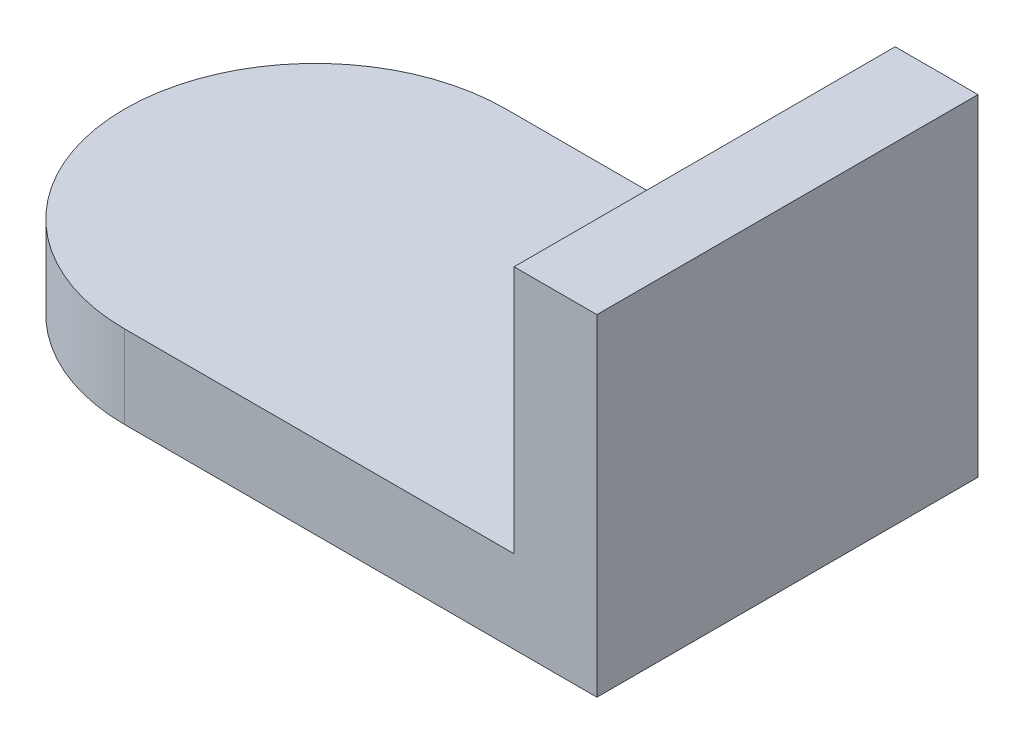
ISO-10303-21;
HEADER;
FILE_DESCRIPTION(('STEP AP214'),'2;1');
FILE_NAME('part.step','',(''),(''),'','','');
FILE_SCHEMA(('AUTOMOTIVE_DESIGN { 1 0 10303 214 1 1 1 1 }'));
ENDSEC;
DATA;
#1=APPLICATION_CONTEXT('core data for automotive mechanical design processes');
#2=APPLICATION_PROTOCOL_DEFINITION('international standard','automotive_design',2000,#1);
#3=PRODUCT_CONTEXT('',#1,'mechanical');
#4=PRODUCT('Part','Part','',(#3));
#5=PRODUCT_RELATED_PRODUCT_CATEGORY('part','',(#4));
#6=PRODUCT_DEFINITION_FORMATION('','',#4);
#7=PRODUCT_DEFINITION_CONTEXT('part definition',#1,'design');
#8=PRODUCT_DEFINITION('design','',#6,#7);
#9=PRODUCT_DEFINITION_SHAPE('','',#8);
#10=(LENGTH_UNIT() NAMED_UNIT(*) SI_UNIT(.MILLI.,.METRE.));
#11=(NAMED_UNIT(*) PLANE_ANGLE_UNIT() SI_UNIT($,.RADIAN.));
#12=(NAMED_UNIT(*) SI_UNIT($,.STERADIAN.) SOLID_ANGLE_UNIT());
#13=UNCERTAINTY_MEASURE_WITH_UNIT(LENGTH_MEASURE(1.E-05),#10,'distance_accuracy_value','');
#14=(GEOMETRIC_REPRESENTATION_CONTEXT(3) GLOBAL_UNCERTAINTY_ASSIGNED_CONTEXT((#13)) GLOBAL_UNIT_ASSIGNED_CONTEXT((#10,
#11,#12)) REPRESENTATION_CONTEXT('',''));
#15=CARTESIAN_POINT('',(0.,0.,0.));
#16=DIRECTION('',(0.,0.,1.));
#17=DIRECTION('',(1.,0.,0.));
#18=AXIS2_PLACEMENT_3D('',#15,#16,#17);
#19=CARTESIAN_POINT('',(1.45,-0.2,-0.365));
#20=DIRECTION('',(0.,0.,-1.));
#21=DIRECTION('',(1.,0.,0.));
#22=AXIS2_PLACEMENT_3D('',#19,#20,#21);
#23=PLANE('',#22);
#24=DIRECTION('',(0.,-1.,0.));
#25=VECTOR('',#24,1.);
#26=CARTESIAN_POINT('',(1.5,-0.2,-0.365));
#27=LINE('',#26,#25);
#28=CARTESIAN_POINT('',(1.5,-0.2,-0.365));
#29=VERTEX_POINT('',#28);
#30=CARTESIAN_POINT('',(1.5,-0.4,-0.365));
#31=VERTEX_POINT('',#30);
#32=EDGE_CURVE('E11',#29,#31,#27,.T.);
#33=ORIENTED_EDGE('',*,*,#32,.T.);
#34=DIRECTION('',(1.,0.,0.));
#35=VECTOR('',#34,1.);
#36=CARTESIAN_POINT('',(1.45,-0.4,-0.365));
#37=LINE('',#36,#35);
#38=CARTESIAN_POINT('',(1.215,-0.4,-0.365));
#39=VERTEX_POINT('',#38);
#40=EDGE_CURVE('E24',#39,#31,#37,.T.);
#41=ORIENTED_EDGE('',*,*,#40,.F.);
#42=DIRECTION('',(0.,-1.,0.));
#43=VECTOR('',#42,1.);
#44=CARTESIAN_POINT('',(1.215,-0.35,-0.365));
#45=LINE('',#44,#43);
#46=CARTESIAN_POINT('',(1.215,-0.35,-0.365));
#47=VERTEX_POINT('',#46);
#48=EDGE_CURVE('E86',#47,#39,#45,.T.);
#49=ORIENTED_EDGE('',*,*,#48,.F.);
#50=DIRECTION('',(-1.,0.,0.));
#51=VECTOR('',#50,1.);
#52=CARTESIAN_POINT('',(1.45,-0.35,-0.365));
#53=LINE('',#52,#51);
#54=CARTESIAN_POINT('',(1.45,-0.35,-0.365));
#55=VERTEX_POINT('',#54);
#56=EDGE_CURVE('E115',#55,#47,#53,.T.);
#57=ORIENTED_EDGE('',*,*,#56,.F.);
#58=DIRECTION('',(0.,-1.,0.));
#59=VECTOR('',#58,1.);
#60=CARTESIAN_POINT('',(1.45,-0.2,-0.365));
#61=LINE('',#60,#59);
#62=CARTESIAN_POINT('',(1.45,-0.2,-0.365));
#63=VERTEX_POINT('',#62);
#64=EDGE_CURVE('E112',#63,#55,#61,.T.);
#65=ORIENTED_EDGE('',*,*,#64,.F.);
#66=DIRECTION('',(1.,0.,0.));
#67=VECTOR('',#66,1.);
#68=CARTESIAN_POINT('',(1.45,-0.2,-0.365));
#69=LINE('',#68,#67);
#70=EDGE_CURVE('E110',#63,#29,#69,.T.);
#71=ORIENTED_EDGE('',*,*,#70,.T.);
#72=EDGE_LOOP('',(#33,#41,#49,#57,#65,#71));
#73=FACE_BOUND('',#72,.T.);
#74=ADVANCED_FACE('F17',(#73),#23,.T.);
#75=CARTESIAN_POINT('',(1.45,-0.2,-0.365));
#76=DIRECTION('',(0.,1.,0.));
#77=DIRECTION('',(0.,0.,1.));
#78=AXIS2_PLACEMENT_3D('',#75,#76,#77);
#79=PLANE('',#78);
#80=DIRECTION('',(0.,0.,-1.));
#81=VECTOR('',#80,1.);
#82=CARTESIAN_POINT('',(1.5,-0.2,-0.365));
#83=LINE('',#82,#81);
#84=CARTESIAN_POINT('',(1.5,-0.2,-0.135));
#85=VERTEX_POINT('',#84);
#86=EDGE_CURVE('E107',#85,#29,#83,.T.);
#87=ORIENTED_EDGE('',*,*,#86,.T.);
#88=ORIENTED_EDGE('',*,*,#70,.F.);
#89=DIRECTION('',(0.,0.,-1.));
#90=VECTOR('',#89,1.);
#91=CARTESIAN_POINT('',(1.45,-0.2,-0.365));
#92=LINE('',#91,#90);
#93=CARTESIAN_POINT('',(1.45,-0.2,-0.135));
#94=VERTEX_POINT('',#93);
#95=EDGE_CURVE('E104',#94,#63,#92,.T.);
#96=ORIENTED_EDGE('',*,*,#95,.F.);
#97=DIRECTION('',(1.,0.,0.));
#98=VECTOR('',#97,1.);
#99=CARTESIAN_POINT('',(1.45,-0.2,-0.135));
#100=LINE('',#99,#98);
#101=EDGE_CURVE('E101',#94,#85,#100,.T.);
#102=ORIENTED_EDGE('',*,*,#101,.T.);
#103=EDGE_LOOP('',(#87,#88,#96,#102));
#104=FACE_BOUND('',#103,.T.);
#105=ADVANCED_FACE('F127',(#104),#79,.T.);
#106=CARTESIAN_POINT('',(1.45,-0.2,-0.135));
#107=DIRECTION('',(0.,0.,1.));
#108=DIRECTION('',(0.,-1.,0.));
#109=AXIS2_PLACEMENT_3D('',#106,#107,#108);
#110=PLANE('',#109);
#111=DIRECTION('',(0.,1.,0.));
#112=VECTOR('',#111,1.);
#113=CARTESIAN_POINT('',(1.5,-0.2,-0.135));
#114=LINE('',#113,#112);
#115=CARTESIAN_POINT('',(1.5,-0.4,-0.134999999999999));
#116=VERTEX_POINT('',#115);
#117=EDGE_CURVE('E99',#116,#85,#114,.T.);
#118=ORIENTED_EDGE('',*,*,#117,.T.);
#119=ORIENTED_EDGE('',*,*,#101,.F.);
#120=DIRECTION('',(0.,1.,0.));
#121=VECTOR('',#120,1.);
#122=CARTESIAN_POINT('',(1.45,-0.2,-0.135));
#123=LINE('',#122,#121);
#124=CARTESIAN_POINT('',(1.45,-0.35,-0.135));
#125=VERTEX_POINT('',#124);
#126=EDGE_CURVE('E96',#125,#94,#123,.T.);
#127=ORIENTED_EDGE('',*,*,#126,.F.);
#128=DIRECTION('',(1.,0.,0.));
#129=VECTOR('',#128,1.);
#130=CARTESIAN_POINT('',(1.45,-0.35,-0.135));
#131=LINE('',#130,#129);
#132=CARTESIAN_POINT('',(1.215,-0.35,-0.134999999999999));
#133=VERTEX_POINT('',#132);
#134=EDGE_CURVE('E72',#133,#125,#131,.T.);
#135=ORIENTED_EDGE('',*,*,#134,.F.);
#136=DIRECTION('',(0.,-1.,0.));
#137=VECTOR('',#136,1.);
#138=CARTESIAN_POINT('',(1.215,-0.35,-0.134999999999999));
#139=LINE('',#138,#137);
#140=CARTESIAN_POINT('',(1.215,-0.4,-0.134999999999999));
#141=VERTEX_POINT('',#140);
#142=EDGE_CURVE('E65',#133,#141,#139,.T.);
#143=ORIENTED_EDGE('',*,*,#142,.T.);
#144=DIRECTION('',(1.,0.,0.));
#145=VECTOR('',#144,1.);
#146=CARTESIAN_POINT('',(1.45,-0.4,-0.134999999999999));
#147=LINE('',#146,#145);
#148=EDGE_CURVE('E69',#141,#116,#147,.T.);
#149=ORIENTED_EDGE('',*,*,#148,.T.);
#150=EDGE_LOOP('',(#118,#119,#127,#135,#143,#149));
#151=FACE_BOUND('',#150,.T.);
#152=ADVANCED_FACE('F68',(#151),#110,.T.);
#153=CARTESIAN_POINT('',(1.45,-0.4,-0.365));
#154=DIRECTION('',(0.,-1.,0.));
#155=DIRECTION('',(0.,0.,-1.));
#156=AXIS2_PLACEMENT_3D('',#153,#154,#155);
#157=PLANE('',#156);
#158=DIRECTION('',(0.,0.,1.));
#159=VECTOR('',#158,1.);
#160=CARTESIAN_POINT('',(1.5,-0.4,-0.365));
#161=LINE('',#160,#159);
#162=EDGE_CURVE('E82',#31,#116,#161,.T.);
#163=ORIENTED_EDGE('',*,*,#162,.T.);
#164=ORIENTED_EDGE('',*,*,#148,.F.);
#165=CARTESIAN_POINT('',(1.215,-0.4,-0.249999999999999));
#166=DIRECTION('',(0.,1.,0.));
#167=DIRECTION('',(0.,0.,1.));
#168=AXIS2_PLACEMENT_3D('',#165,#166,#167);
#169=CIRCLE('',#168,0.115);
#170=EDGE_CURVE('E81',#39,#141,#169,.T.);
#171=ORIENTED_EDGE('',*,*,#170,.F.);
#172=ORIENTED_EDGE('',*,*,#40,.T.);
#173=EDGE_LOOP('',(#163,#164,#171,#172));
#174=FACE_BOUND('',#173,.T.);
#175=ADVANCED_FACE('F80',(#174),#157,.T.);
#176=CARTESIAN_POINT('',(1.45,0.,0.));
#177=DIRECTION('',(1.,0.,0.));
#178=DIRECTION('',(0.,0.,1.));
#179=AXIS2_PLACEMENT_3D('',#176,#177,#178);
#180=PLANE('',#179);
#181=ORIENTED_EDGE('',*,*,#126,.T.);
#182=ORIENTED_EDGE('',*,*,#95,.T.);
#183=ORIENTED_EDGE('',*,*,#64,.T.);
#184=DIRECTION('',(0.,0.,-1.));
#185=VECTOR('',#184,1.);
#186=CARTESIAN_POINT('',(1.45,-0.35,-0.365));
#187=LINE('',#186,#185);
#188=EDGE_CURVE('E87',#125,#55,#187,.T.);
#189=ORIENTED_EDGE('',*,*,#188,.F.);
#190=EDGE_LOOP('',(#181,#182,#183,#189));
#191=FACE_BOUND('',#190,.T.);
#192=ADVANCED_FACE('F123',(#191),#180,.F.);
#193=CARTESIAN_POINT('',(1.5,0.,0.));
#194=DIRECTION('',(1.,0.,0.));
#195=DIRECTION('',(0.,0.,1.));
#196=AXIS2_PLACEMENT_3D('',#193,#194,#195);
#197=PLANE('',#196);
#198=ORIENTED_EDGE('',*,*,#32,.F.);
#199=ORIENTED_EDGE('',*,*,#86,.F.);
#200=ORIENTED_EDGE('',*,*,#117,.F.);
#201=ORIENTED_EDGE('',*,*,#162,.F.);
#202=EDGE_LOOP('',(#198,#199,#200,#201));
#203=FACE_BOUND('',#202,.T.);
#204=ADVANCED_FACE('F118',(#203),#197,.T.);
#205=CARTESIAN_POINT('',(1.215,-0.35,-0.249999999999999));
#206=DIRECTION('',(0.,-1.,0.));
#207=DIRECTION('',(0.,0.,-1.));
#208=AXIS2_PLACEMENT_3D('',#205,#206,#207);
#209=CYLINDRICAL_SURFACE('',#208,0.115);
#210=ORIENTED_EDGE('',*,*,#170,.T.);
#211=ORIENTED_EDGE('',*,*,#142,.F.);
#212=CARTESIAN_POINT('',(1.215,-0.35,-0.249999999999999));
#213=DIRECTION('',(0.,1.,0.));
#214=DIRECTION('',(0.,0.,1.));
#215=AXIS2_PLACEMENT_3D('',#212,#213,#214);
#216=CIRCLE('',#215,0.115);
#217=EDGE_CURVE('E91',#47,#133,#216,.T.);
#218=ORIENTED_EDGE('',*,*,#217,.F.);
#219=ORIENTED_EDGE('',*,*,#48,.T.);
#220=EDGE_LOOP('',(#210,#211,#218,#219));
#221=FACE_BOUND('',#220,.T.);
#222=ADVANCED_FACE('F85',(#221),#209,.T.);
#223=CARTESIAN_POINT('',(1.215,-0.35,-0.249999999999999));
#224=DIRECTION('',(0.,1.,0.));
#225=DIRECTION('',(0.,0.,1.));
#226=AXIS2_PLACEMENT_3D('',#223,#224,#225);
#227=PLANE('',#226);
#228=ORIENTED_EDGE('',*,*,#188,.T.);
#229=ORIENTED_EDGE('',*,*,#56,.T.);
#230=ORIENTED_EDGE('',*,*,#217,.T.);
#231=ORIENTED_EDGE('',*,*,#134,.T.);
#232=EDGE_LOOP('',(#228,#229,#230,#231));
#233=FACE_BOUND('',#232,.T.);
#234=ADVANCED_FACE('F125',(#233),#227,.T.);
#235=CLOSED_SHELL('',(#74,#105,#152,#175,#192,#204,#222,#234));
#236=MANIFOLD_SOLID_BREP('B1',#235);
#237=ADVANCED_BREP_SHAPE_REPRESENTATION('',(#18,#236),#14);
#238=SHAPE_DEFINITION_REPRESENTATION(#9,#237);
ENDSEC;
END-ISO-10303-21;
